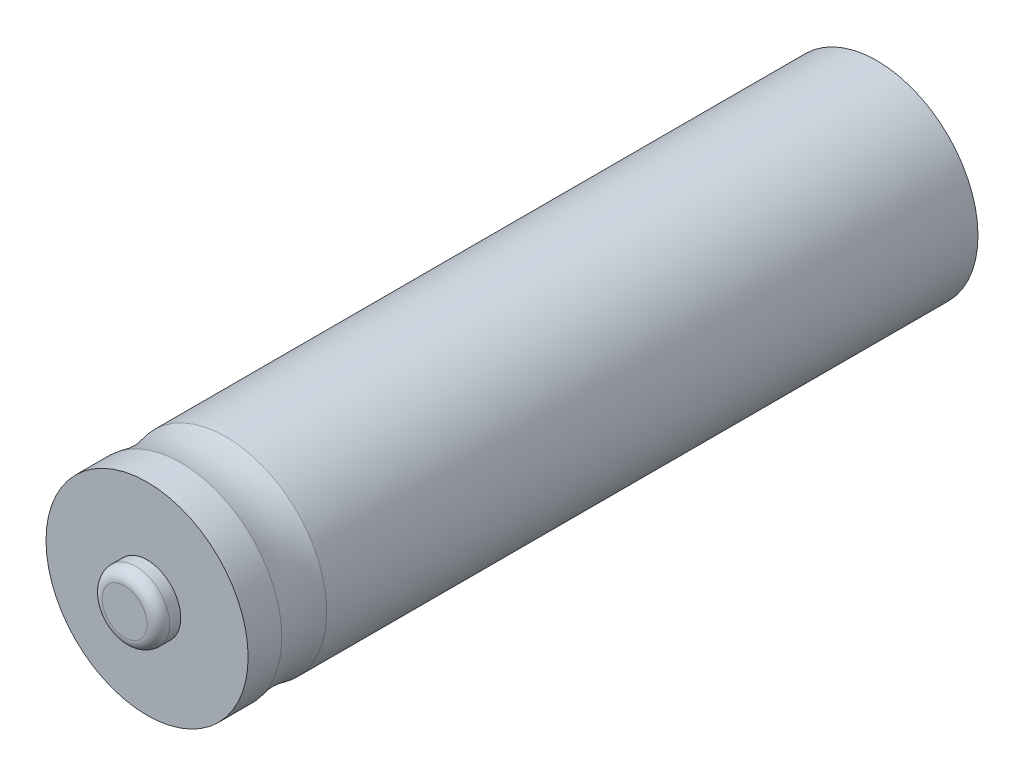
ISO-10303-21;
HEADER;
FILE_DESCRIPTION(('STEP AP214'),'2;1');
FILE_NAME('part.step','',(''),(''),'','','');
FILE_SCHEMA(('AUTOMOTIVE_DESIGN { 1 0 10303 214 1 1 1 1 }'));
ENDSEC;
DATA;
#1=APPLICATION_CONTEXT('core data for automotive mechanical design processes');
#2=APPLICATION_PROTOCOL_DEFINITION('international standard','automotive_design',2000,#1);
#3=PRODUCT_CONTEXT('',#1,'mechanical');
#4=PRODUCT('Part','Part','',(#3));
#5=PRODUCT_RELATED_PRODUCT_CATEGORY('part','',(#4));
#6=PRODUCT_DEFINITION_FORMATION('','',#4);
#7=PRODUCT_DEFINITION_CONTEXT('part definition',#1,'design');
#8=PRODUCT_DEFINITION('design','',#6,#7);
#9=PRODUCT_DEFINITION_SHAPE('','',#8);
#10=(LENGTH_UNIT() NAMED_UNIT(*) SI_UNIT(.MILLI.,.METRE.));
#11=(NAMED_UNIT(*) PLANE_ANGLE_UNIT() SI_UNIT($,.RADIAN.));
#12=(NAMED_UNIT(*) SI_UNIT($,.STERADIAN.) SOLID_ANGLE_UNIT());
#13=UNCERTAINTY_MEASURE_WITH_UNIT(LENGTH_MEASURE(1.E-05),#10,'distance_accuracy_value','');
#14=(GEOMETRIC_REPRESENTATION_CONTEXT(3) GLOBAL_UNCERTAINTY_ASSIGNED_CONTEXT((#13)) GLOBAL_UNIT_ASSIGNED_CONTEXT((#10,
#11,#12)) REPRESENTATION_CONTEXT('',''));
#15=CARTESIAN_POINT('',(0.,0.,0.));
#16=DIRECTION('',(0.,0.,1.));
#17=DIRECTION('',(1.,0.,0.));
#18=AXIS2_PLACEMENT_3D('',#15,#16,#17);
#19=CARTESIAN_POINT('',(0.,0.,32.5));
#20=DIRECTION('',(0.,0.,-1.));
#21=DIRECTION('',(-1.,0.,0.));
#22=AXIS2_PLACEMENT_3D('',#19,#20,#21);
#23=CYLINDRICAL_SURFACE('',#22,9.);
#24=CARTESIAN_POINT('',(0.,0.,29.5));
#25=DIRECTION('',(0.,0.,-1.));
#26=DIRECTION('',(-1.,0.,0.));
#27=AXIS2_PLACEMENT_3D('',#24,#25,#26);
#28=CIRCLE('',#27,9.);
#29=CARTESIAN_POINT('',(-9.,0.,29.5));
#30=VERTEX_POINT('',#29);
#31=EDGE_CURVE('E55',#30,#30,#28,.T.);
#32=ORIENTED_EDGE('',*,*,#31,.F.);
#33=EDGE_LOOP('',(#32));
#34=FACE_BOUND('',#33,.T.);
#35=CARTESIAN_POINT('',(0.,0.,32.5));
#36=DIRECTION('',(0.,0.,1.));
#37=DIRECTION('',(1.,0.,0.));
#38=AXIS2_PLACEMENT_3D('',#35,#36,#37);
#39=CIRCLE('',#38,9.);
#40=CARTESIAN_POINT('',(9.,0.,32.5));
#41=VERTEX_POINT('',#40);
#42=EDGE_CURVE('E65',#41,#41,#39,.T.);
#43=ORIENTED_EDGE('',*,*,#42,.F.);
#44=EDGE_LOOP('',(#43));
#45=FACE_BOUND('',#44,.T.);
#46=ADVANCED_FACE('F39',(#34,#45),#23,.T.);
#47=CARTESIAN_POINT('',(0.,0.,32.5));
#48=DIRECTION('',(0.,0.,1.));
#49=DIRECTION('',(1.,0.,0.));
#50=AXIS2_PLACEMENT_3D('',#47,#48,#49);
#51=PLANE('',#50);
#52=CARTESIAN_POINT('',(0.,0.,32.5));
#53=DIRECTION('',(0.,0.,1.));
#54=DIRECTION('',(1.,0.,0.));
#55=AXIS2_PLACEMENT_3D('',#52,#53,#54);
#56=CIRCLE('',#55,3.);
#57=CARTESIAN_POINT('',(3.,0.,32.5));
#58=VERTEX_POINT('',#57);
#59=EDGE_CURVE('E62',#58,#58,#56,.T.);
#60=ORIENTED_EDGE('',*,*,#59,.F.);
#61=EDGE_LOOP('',(#60));
#62=FACE_BOUND('',#61,.T.);
#63=ORIENTED_EDGE('',*,*,#42,.T.);
#64=EDGE_LOOP('',(#63));
#65=FACE_BOUND('',#64,.T.);
#66=ADVANCED_FACE('F88',(#62,#65),#51,.T.);
#67=CARTESIAN_POINT('',(0.,0.,34.5));
#68=DIRECTION('',(0.,0.,-1.));
#69=DIRECTION('',(-1.,0.,0.));
#70=AXIS2_PLACEMENT_3D('',#67,#68,#69);
#71=CYLINDRICAL_SURFACE('',#70,3.);
#72=CARTESIAN_POINT('',(0.,0.,33.5));
#73=DIRECTION('',(0.,0.,1.));
#74=DIRECTION('',(1.,0.,0.));
#75=AXIS2_PLACEMENT_3D('',#72,#73,#74);
#76=CIRCLE('',#75,3.);
#77=CARTESIAN_POINT('',(3.,0.,33.5));
#78=VERTEX_POINT('',#77);
#79=EDGE_CURVE('E43',#78,#78,#76,.F.);
#80=ORIENTED_EDGE('',*,*,#79,.T.);
#81=EDGE_LOOP('',(#80));
#82=FACE_BOUND('',#81,.T.);
#83=ORIENTED_EDGE('',*,*,#59,.T.);
#84=EDGE_LOOP('',(#83));
#85=FACE_BOUND('',#84,.T.);
#86=ADVANCED_FACE('F84',(#82,#85),#71,.T.);
#87=CARTESIAN_POINT('',(0.,0.,34.5));
#88=DIRECTION('',(0.,0.,1.));
#89=DIRECTION('',(1.,0.,0.));
#90=AXIS2_PLACEMENT_3D('',#87,#88,#89);
#91=PLANE('',#90);
#92=CARTESIAN_POINT('',(0.,0.,34.5));
#93=DIRECTION('',(0.,0.,1.));
#94=DIRECTION('',(1.,0.,0.));
#95=AXIS2_PLACEMENT_3D('',#92,#93,#94);
#96=CIRCLE('',#95,2.);
#97=CARTESIAN_POINT('',(2.,0.,34.5));
#98=VERTEX_POINT('',#97);
#99=EDGE_CURVE('E51',#98,#98,#96,.T.);
#100=ORIENTED_EDGE('',*,*,#99,.T.);
#101=EDGE_LOOP('',(#100));
#102=FACE_BOUND('',#101,.T.);
#103=ADVANCED_FACE('F72',(#102),#91,.T.);
#104=CARTESIAN_POINT('',(0.,0.,33.5));
#105=DIRECTION('',(0.,0.,1.));
#106=DIRECTION('',(1.,0.,0.));
#107=AXIS2_PLACEMENT_3D('',#104,#105,#106);
#108=TOROIDAL_SURFACE('',#107,2.,1.);
#109=ORIENTED_EDGE('',*,*,#79,.F.);
#110=EDGE_LOOP('',(#109));
#111=FACE_BOUND('',#110,.T.);
#112=ORIENTED_EDGE('',*,*,#99,.F.);
#113=EDGE_LOOP('',(#112));
#114=FACE_BOUND('',#113,.T.);
#115=ADVANCED_FACE('F41',(#111,#114),#108,.T.);
#116=CARTESIAN_POINT('',(0.,0.,27.5));
#117=DIRECTION('',(0.,0.,-1.));
#118=DIRECTION('',(-1.,0.,0.));
#119=AXIS2_PLACEMENT_3D('',#116,#117,#118);
#120=TOROIDAL_SURFACE('',#119,16.5443698743945,7.80496744398532);
#121=CARTESIAN_POINT('',(0.,0.,25.5));
#122=DIRECTION('',(0.,0.,-1.));
#123=DIRECTION('',(-1.,0.,0.));
#124=AXIS2_PLACEMENT_3D('',#121,#122,#123);
#125=CIRCLE('',#124,9.);
#126=CARTESIAN_POINT('',(-9.,0.,25.5));
#127=VERTEX_POINT('',#126);
#128=EDGE_CURVE('E58',#127,#127,#125,.T.);
#129=ORIENTED_EDGE('',*,*,#128,.F.);
#130=EDGE_LOOP('',(#129));
#131=FACE_BOUND('',#130,.T.);
#132=ORIENTED_EDGE('',*,*,#31,.T.);
#133=EDGE_LOOP('',(#132));
#134=FACE_BOUND('',#133,.T.);
#135=ADVANCED_FACE('F75',(#131,#134),#120,.F.);
#136=CARTESIAN_POINT('',(0.,0.,-32.5));
#137=DIRECTION('',(0.,0.,1.));
#138=DIRECTION('',(1.,0.,0.));
#139=AXIS2_PLACEMENT_3D('',#136,#137,#138);
#140=PLANE('',#139);
#141=CARTESIAN_POINT('',(0.,0.,-32.5));
#142=DIRECTION('',(0.,0.,-1.));
#143=DIRECTION('',(-1.,0.,0.));
#144=AXIS2_PLACEMENT_3D('',#141,#142,#143);
#145=CIRCLE('',#144,5.5);
#146=CARTESIAN_POINT('',(-5.5,0.,-32.5));
#147=VERTEX_POINT('',#146);
#148=EDGE_CURVE('E10',#147,#147,#145,.T.);
#149=ORIENTED_EDGE('',*,*,#148,.F.);
#150=EDGE_LOOP('',(#149));
#151=FACE_BOUND('',#150,.T.);
#152=CARTESIAN_POINT('',(0.,0.,-32.5));
#153=DIRECTION('',(0.,0.,1.));
#154=DIRECTION('',(1.,0.,0.));
#155=AXIS2_PLACEMENT_3D('',#152,#153,#154);
#156=CIRCLE('',#155,9.);
#157=CARTESIAN_POINT('',(9.,0.,-32.5));
#158=VERTEX_POINT('',#157);
#159=EDGE_CURVE('E61',#158,#158,#156,.T.);
#160=ORIENTED_EDGE('',*,*,#159,.F.);
#161=EDGE_LOOP('',(#160));
#162=FACE_BOUND('',#161,.T.);
#163=ADVANCED_FACE('F81',(#151,#162),#140,.F.);
#164=ORIENTED_EDGE('',*,*,#128,.T.);
#165=EDGE_LOOP('',(#164));
#166=FACE_BOUND('',#165,.T.);
#167=ORIENTED_EDGE('',*,*,#159,.T.);
#168=EDGE_LOOP('',(#167));
#169=FACE_BOUND('',#168,.T.);
#170=ADVANCED_FACE('F90',(#166,#169),#23,.T.);
#171=CARTESIAN_POINT('',(0.,0.,-32.9));
#172=DIRECTION('',(0.,0.,1.));
#173=DIRECTION('',(1.,0.,0.));
#174=AXIS2_PLACEMENT_3D('',#171,#172,#173);
#175=CYLINDRICAL_SURFACE('',#174,5.5);
#176=CARTESIAN_POINT('',(0.,0.,-32.9));
#177=DIRECTION('',(0.,0.,-1.));
#178=DIRECTION('',(-1.,0.,0.));
#179=AXIS2_PLACEMENT_3D('',#176,#177,#178);
#180=CIRCLE('',#179,5.5);
#181=CARTESIAN_POINT('',(-5.5,0.,-32.9));
#182=VERTEX_POINT('',#181);
#183=EDGE_CURVE('E54',#182,#182,#180,.T.);
#184=ORIENTED_EDGE('',*,*,#183,.F.);
#185=EDGE_LOOP('',(#184));
#186=FACE_BOUND('',#185,.T.);
#187=ORIENTED_EDGE('',*,*,#148,.T.);
#188=EDGE_LOOP('',(#187));
#189=FACE_BOUND('',#188,.T.);
#190=ADVANCED_FACE('F100',(#186,#189),#175,.T.);
#191=CARTESIAN_POINT('',(0.,0.,-32.9));
#192=DIRECTION('',(0.,0.,-1.));
#193=DIRECTION('',(-1.,0.,0.));
#194=AXIS2_PLACEMENT_3D('',#191,#192,#193);
#195=PLANE('',#194);
#196=ORIENTED_EDGE('',*,*,#183,.T.);
#197=EDGE_LOOP('',(#196));
#198=FACE_BOUND('',#197,.T.);
#199=ADVANCED_FACE('F106',(#198),#195,.T.);
#200=CLOSED_SHELL('',(#46,#66,#86,#103,#115,#135,#163,#170,#190,#199));
#201=MANIFOLD_SOLID_BREP('B2',#200);
#202=ADVANCED_BREP_SHAPE_REPRESENTATION('',(#18,#201),#14);
#203=SHAPE_DEFINITION_REPRESENTATION(#9,#202);
ENDSEC;
END-ISO-10303-21;
